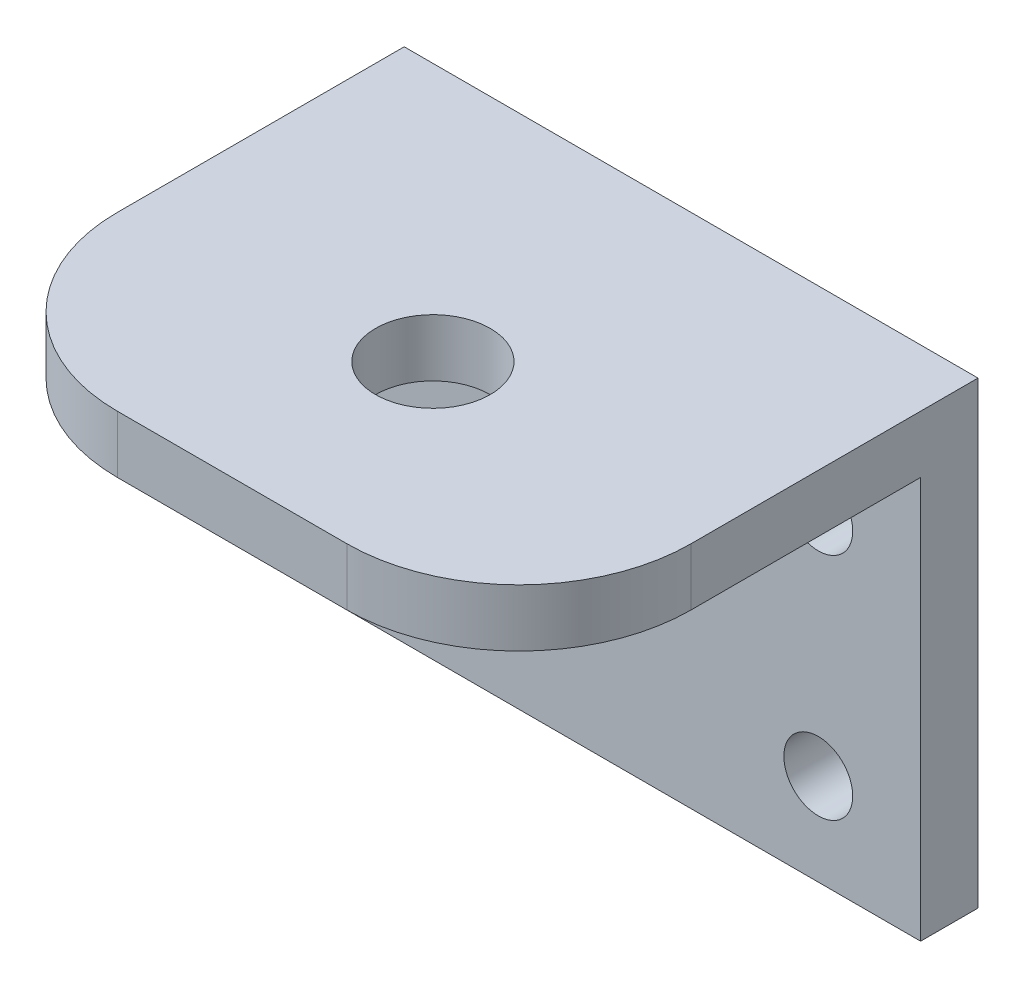
ISO-10303-21;
HEADER;
FILE_DESCRIPTION(('STEP AP214'),'2;1');
FILE_NAME('part.step','',(''),(''),'','','');
FILE_SCHEMA(('AUTOMOTIVE_DESIGN { 1 0 10303 214 1 1 1 1 }'));
ENDSEC;
DATA;
#1=APPLICATION_CONTEXT('core data for automotive mechanical design processes');
#2=APPLICATION_PROTOCOL_DEFINITION('international standard','automotive_design',2000,#1);
#3=PRODUCT_CONTEXT('',#1,'mechanical');
#4=PRODUCT('Part','Part','',(#3));
#5=PRODUCT_RELATED_PRODUCT_CATEGORY('part','',(#4));
#6=PRODUCT_DEFINITION_FORMATION('','',#4);
#7=PRODUCT_DEFINITION_CONTEXT('part definition',#1,'design');
#8=PRODUCT_DEFINITION('design','',#6,#7);
#9=PRODUCT_DEFINITION_SHAPE('','',#8);
#10=(LENGTH_UNIT() NAMED_UNIT(*) SI_UNIT(.MILLI.,.METRE.));
#11=(NAMED_UNIT(*) PLANE_ANGLE_UNIT() SI_UNIT($,.RADIAN.));
#12=(NAMED_UNIT(*) SI_UNIT($,.STERADIAN.) SOLID_ANGLE_UNIT());
#13=UNCERTAINTY_MEASURE_WITH_UNIT(LENGTH_MEASURE(1.E-05),#10,'distance_accuracy_value','');
#14=(GEOMETRIC_REPRESENTATION_CONTEXT(3) GLOBAL_UNCERTAINTY_ASSIGNED_CONTEXT((#13)) GLOBAL_UNIT_ASSIGNED_CONTEXT((#10,
#11,#12)) REPRESENTATION_CONTEXT('',''));
#15=CARTESIAN_POINT('',(0.,0.,0.));
#16=DIRECTION('',(0.,0.,1.));
#17=DIRECTION('',(1.,0.,0.));
#18=AXIS2_PLACEMENT_3D('',#15,#16,#17);
#19=CARTESIAN_POINT('',(25.,-20.,40.));
#20=DIRECTION('',(-1.,0.,0.));
#21=DIRECTION('',(0.,0.,1.));
#22=AXIS2_PLACEMENT_3D('',#19,#20,#21);
#23=PLANE('',#22);
#24=DIRECTION('',(0.,0.,-1.));
#25=VECTOR('',#24,1.);
#26=CARTESIAN_POINT('',(25.,20.,40.));
#27=LINE('',#26,#25);
#28=CARTESIAN_POINT('',(25.,20.,25.));
#29=VERTEX_POINT('',#28);
#30=CARTESIAN_POINT('',(25.,20.,0.));
#31=VERTEX_POINT('',#30);
#32=EDGE_CURVE('E145',#29,#31,#27,.T.);
#33=ORIENTED_EDGE('',*,*,#32,.F.);
#34=DIRECTION('',(0.,1.,0.));
#35=VECTOR('',#34,1.);
#36=CARTESIAN_POINT('',(25.,-20.,25.));
#37=LINE('',#36,#35);
#38=CARTESIAN_POINT('',(25.,15.,25.));
#39=VERTEX_POINT('',#38);
#40=EDGE_CURVE('E11',#29,#39,#37,.F.);
#41=ORIENTED_EDGE('',*,*,#40,.T.);
#42=DIRECTION('',(0.,0.,1.));
#43=VECTOR('',#42,1.);
#44=CARTESIAN_POINT('',(25.,15.,40.));
#45=LINE('',#44,#43);
#46=CARTESIAN_POINT('',(25.,15.,5.));
#47=VERTEX_POINT('',#46);
#48=EDGE_CURVE('E114',#47,#39,#45,.T.);
#49=ORIENTED_EDGE('',*,*,#48,.F.);
#50=DIRECTION('',(0.,-1.,0.));
#51=VECTOR('',#50,1.);
#52=CARTESIAN_POINT('',(25.,15.,5.));
#53=LINE('',#52,#51);
#54=CARTESIAN_POINT('',(25.,-20.,5.));
#55=VERTEX_POINT('',#54);
#56=EDGE_CURVE('E113',#47,#55,#53,.T.);
#57=ORIENTED_EDGE('',*,*,#56,.T.);
#58=DIRECTION('',(0.,0.,-1.));
#59=VECTOR('',#58,1.);
#60=CARTESIAN_POINT('',(25.,-20.,40.));
#61=LINE('',#60,#59);
#62=CARTESIAN_POINT('',(25.,-20.,0.));
#63=VERTEX_POINT('',#62);
#64=EDGE_CURVE('E130',#55,#63,#61,.T.);
#65=ORIENTED_EDGE('',*,*,#64,.T.);
#66=DIRECTION('',(0.,1.,0.));
#67=VECTOR('',#66,1.);
#68=CARTESIAN_POINT('',(25.,-20.,0.));
#69=LINE('',#68,#67);
#70=EDGE_CURVE('E122',#63,#31,#69,.T.);
#71=ORIENTED_EDGE('',*,*,#70,.T.);
#72=EDGE_LOOP('',(#33,#41,#49,#57,#65,#71));
#73=FACE_BOUND('',#72,.T.);
#74=ADVANCED_FACE('F33',(#73),#23,.F.);
#75=CARTESIAN_POINT('',(-25.,20.,40.));
#76=DIRECTION('',(0.,-1.,0.));
#77=DIRECTION('',(0.,0.,-1.));
#78=AXIS2_PLACEMENT_3D('',#75,#76,#77);
#79=PLANE('',#78);
#80=CARTESIAN_POINT('',(0.,20.,22.5));
#81=DIRECTION('',(0.,-1.,0.));
#82=DIRECTION('',(0.,0.,-1.));
#83=AXIS2_PLACEMENT_3D('',#80,#81,#82);
#84=CIRCLE('',#83,5.);
#85=CARTESIAN_POINT('',(0.,20.,17.5));
#86=VERTEX_POINT('',#85);
#87=EDGE_CURVE('E256',#86,#86,#84,.T.);
#88=ORIENTED_EDGE('',*,*,#87,.T.);
#89=EDGE_LOOP('',(#88));
#90=FACE_BOUND('',#89,.T.);
#91=DIRECTION('',(0.,0.,-1.));
#92=VECTOR('',#91,1.);
#93=CARTESIAN_POINT('',(-25.,20.,40.));
#94=LINE('',#93,#92);
#95=CARTESIAN_POINT('',(-25.,20.,25.));
#96=VERTEX_POINT('',#95);
#97=CARTESIAN_POINT('',(-25.,20.,0.));
#98=VERTEX_POINT('',#97);
#99=EDGE_CURVE('E143',#96,#98,#94,.T.);
#100=ORIENTED_EDGE('',*,*,#99,.F.);
#101=CARTESIAN_POINT('',(-10.,20.,25.));
#102=DIRECTION('',(0.,-1.,0.));
#103=DIRECTION('',(0.,0.,-1.));
#104=AXIS2_PLACEMENT_3D('',#101,#102,#103);
#105=CIRCLE('',#104,15.);
#106=CARTESIAN_POINT('',(-10.,20.,40.));
#107=VERTEX_POINT('',#106);
#108=EDGE_CURVE('E41',#96,#107,#105,.F.);
#109=ORIENTED_EDGE('',*,*,#108,.T.);
#110=DIRECTION('',(-1.,0.,0.));
#111=VECTOR('',#110,1.);
#112=CARTESIAN_POINT('',(-25.,20.,40.));
#113=LINE('',#112,#111);
#114=CARTESIAN_POINT('',(10.,20.,40.));
#115=VERTEX_POINT('',#114);
#116=EDGE_CURVE('E127',#115,#107,#113,.T.);
#117=ORIENTED_EDGE('',*,*,#116,.F.);
#118=CARTESIAN_POINT('',(10.,20.,25.));
#119=DIRECTION('',(0.,-1.,0.));
#120=DIRECTION('',(0.,0.,-1.));
#121=AXIS2_PLACEMENT_3D('',#118,#119,#120);
#122=CIRCLE('',#121,15.);
#123=EDGE_CURVE('E48',#115,#29,#122,.F.);
#124=ORIENTED_EDGE('',*,*,#123,.T.);
#125=ORIENTED_EDGE('',*,*,#32,.T.);
#126=DIRECTION('',(-1.,0.,0.));
#127=VECTOR('',#126,1.);
#128=CARTESIAN_POINT('',(-25.,20.,0.));
#129=LINE('',#128,#127);
#130=EDGE_CURVE('E134',#31,#98,#129,.T.);
#131=ORIENTED_EDGE('',*,*,#130,.T.);
#132=EDGE_LOOP('',(#100,#109,#117,#124,#125,#131));
#133=FACE_BOUND('',#132,.T.);
#134=ADVANCED_FACE('F173',(#90,#133),#79,.F.);
#135=CARTESIAN_POINT('',(-25.,-20.,40.));
#136=DIRECTION('',(1.,0.,0.));
#137=DIRECTION('',(0.,0.,-1.));
#138=AXIS2_PLACEMENT_3D('',#135,#136,#137);
#139=PLANE('',#138);
#140=DIRECTION('',(0.,0.,-1.));
#141=VECTOR('',#140,1.);
#142=CARTESIAN_POINT('',(-25.,15.,40.));
#143=LINE('',#142,#141);
#144=CARTESIAN_POINT('',(-25.,15.,25.));
#145=VERTEX_POINT('',#144);
#146=CARTESIAN_POINT('',(-25.,15.,5.));
#147=VERTEX_POINT('',#146);
#148=EDGE_CURVE('E97',#145,#147,#143,.T.);
#149=ORIENTED_EDGE('',*,*,#148,.F.);
#150=DIRECTION('',(0.,-1.,0.));
#151=VECTOR('',#150,1.);
#152=CARTESIAN_POINT('',(-25.,-20.,25.));
#153=LINE('',#152,#151);
#154=EDGE_CURVE('E56',#145,#96,#153,.F.);
#155=ORIENTED_EDGE('',*,*,#154,.T.);
#156=ORIENTED_EDGE('',*,*,#99,.T.);
#157=DIRECTION('',(0.,-1.,0.));
#158=VECTOR('',#157,1.);
#159=CARTESIAN_POINT('',(-25.,-20.,0.));
#160=LINE('',#159,#158);
#161=CARTESIAN_POINT('',(-25.,-20.,0.));
#162=VERTEX_POINT('',#161);
#163=EDGE_CURVE('E137',#98,#162,#160,.T.);
#164=ORIENTED_EDGE('',*,*,#163,.T.);
#165=DIRECTION('',(0.,0.,-1.));
#166=VECTOR('',#165,1.);
#167=CARTESIAN_POINT('',(-25.,-20.,40.));
#168=LINE('',#167,#166);
#169=CARTESIAN_POINT('',(-25.,-20.,5.));
#170=VERTEX_POINT('',#169);
#171=EDGE_CURVE('E119',#170,#162,#168,.T.);
#172=ORIENTED_EDGE('',*,*,#171,.F.);
#173=DIRECTION('',(0.,-1.,0.));
#174=VECTOR('',#173,1.);
#175=CARTESIAN_POINT('',(-25.,15.,5.));
#176=LINE('',#175,#174);
#177=EDGE_CURVE('E110',#147,#170,#176,.T.);
#178=ORIENTED_EDGE('',*,*,#177,.F.);
#179=EDGE_LOOP('',(#149,#155,#156,#164,#172,#178));
#180=FACE_BOUND('',#179,.T.);
#181=ADVANCED_FACE('F117',(#180),#139,.F.);
#182=CARTESIAN_POINT('',(-25.,-20.,40.));
#183=DIRECTION('',(0.,1.,0.));
#184=DIRECTION('',(0.,0.,1.));
#185=AXIS2_PLACEMENT_3D('',#182,#183,#184);
#186=PLANE('',#185);
#187=ORIENTED_EDGE('',*,*,#64,.F.);
#188=DIRECTION('',(1.,0.,0.));
#189=VECTOR('',#188,1.);
#190=CARTESIAN_POINT('',(25.,-20.,5.));
#191=LINE('',#190,#189);
#192=EDGE_CURVE('E106',#170,#55,#191,.T.);
#193=ORIENTED_EDGE('',*,*,#192,.F.);
#194=ORIENTED_EDGE('',*,*,#171,.T.);
#195=DIRECTION('',(1.,0.,0.));
#196=VECTOR('',#195,1.);
#197=CARTESIAN_POINT('',(-25.,-20.,0.));
#198=LINE('',#197,#196);
#199=EDGE_CURVE('E131',#162,#63,#198,.T.);
#200=ORIENTED_EDGE('',*,*,#199,.T.);
#201=EDGE_LOOP('',(#187,#193,#194,#200));
#202=FACE_BOUND('',#201,.T.);
#203=ADVANCED_FACE('F202',(#202),#186,.F.);
#204=CARTESIAN_POINT('',(0.,0.,40.));
#205=DIRECTION('',(0.,0.,-1.));
#206=DIRECTION('',(-1.,0.,0.));
#207=AXIS2_PLACEMENT_3D('',#204,#205,#206);
#208=PLANE('',#207);
#209=ORIENTED_EDGE('',*,*,#116,.T.);
#210=DIRECTION('',(0.,-1.,0.));
#211=VECTOR('',#210,1.);
#212=CARTESIAN_POINT('',(-10.,0.,40.));
#213=LINE('',#212,#211);
#214=CARTESIAN_POINT('',(-10.,15.,40.));
#215=VERTEX_POINT('',#214);
#216=EDGE_CURVE('E165',#107,#215,#213,.T.);
#217=ORIENTED_EDGE('',*,*,#216,.T.);
#218=DIRECTION('',(-1.,0.,0.));
#219=VECTOR('',#218,1.);
#220=CARTESIAN_POINT('',(25.,15.,40.));
#221=LINE('',#220,#219);
#222=CARTESIAN_POINT('',(10.,15.,40.));
#223=VERTEX_POINT('',#222);
#224=EDGE_CURVE('E120',#223,#215,#221,.T.);
#225=ORIENTED_EDGE('',*,*,#224,.F.);
#226=DIRECTION('',(0.,1.,0.));
#227=VECTOR('',#226,1.);
#228=CARTESIAN_POINT('',(10.,0.,40.));
#229=LINE('',#228,#227);
#230=EDGE_CURVE('E147',#223,#115,#229,.T.);
#231=ORIENTED_EDGE('',*,*,#230,.T.);
#232=EDGE_LOOP('',(#209,#217,#225,#231));
#233=FACE_BOUND('',#232,.T.);
#234=ADVANCED_FACE('F177',(#233),#208,.F.);
#235=CARTESIAN_POINT('',(0.,0.,0.));
#236=DIRECTION('',(0.,0.,-1.));
#237=DIRECTION('',(-1.,0.,0.));
#238=AXIS2_PLACEMENT_3D('',#235,#236,#237);
#239=PLANE('',#238);
#240=CARTESIAN_POINT('',(16.0827883139668,-12.,0.));
#241=DIRECTION('',(0.,0.,-1.));
#242=DIRECTION('',(-1.,0.,0.));
#243=AXIS2_PLACEMENT_3D('',#240,#241,#242);
#244=CIRCLE('',#243,3.);
#245=CARTESIAN_POINT('',(13.0827883139668,-12.,0.));
#246=VERTEX_POINT('',#245);
#247=EDGE_CURVE('E157',#246,#246,#244,.T.);
#248=ORIENTED_EDGE('',*,*,#247,.F.);
#249=EDGE_LOOP('',(#248));
#250=FACE_BOUND('',#249,.T.);
#251=CARTESIAN_POINT('',(16.0827883139668,8.,0.));
#252=DIRECTION('',(0.,0.,-1.));
#253=DIRECTION('',(-1.,0.,0.));
#254=AXIS2_PLACEMENT_3D('',#251,#252,#253);
#255=CIRCLE('',#254,3.);
#256=CARTESIAN_POINT('',(13.0827883139668,8.,0.));
#257=VERTEX_POINT('',#256);
#258=EDGE_CURVE('E237',#257,#257,#255,.T.);
#259=ORIENTED_EDGE('',*,*,#258,.F.);
#260=EDGE_LOOP('',(#259));
#261=FACE_BOUND('',#260,.T.);
#262=CARTESIAN_POINT('',(-13.9172116860332,8.,0.));
#263=DIRECTION('',(0.,0.,-1.));
#264=DIRECTION('',(-1.,0.,0.));
#265=AXIS2_PLACEMENT_3D('',#262,#263,#264);
#266=CIRCLE('',#265,3.);
#267=CARTESIAN_POINT('',(-16.9172116860332,8.,0.));
#268=VERTEX_POINT('',#267);
#269=EDGE_CURVE('E247',#268,#268,#266,.T.);
#270=ORIENTED_EDGE('',*,*,#269,.F.);
#271=EDGE_LOOP('',(#270));
#272=FACE_BOUND('',#271,.T.);
#273=CARTESIAN_POINT('',(-13.9172116860332,-12.,0.));
#274=DIRECTION('',(0.,0.,-1.));
#275=DIRECTION('',(-1.,0.,0.));
#276=AXIS2_PLACEMENT_3D('',#273,#274,#275);
#277=CIRCLE('',#276,3.);
#278=CARTESIAN_POINT('',(-16.9172116860332,-12.,0.));
#279=VERTEX_POINT('',#278);
#280=EDGE_CURVE('E152',#279,#279,#277,.T.);
#281=ORIENTED_EDGE('',*,*,#280,.F.);
#282=EDGE_LOOP('',(#281));
#283=FACE_BOUND('',#282,.T.);
#284=ORIENTED_EDGE('',*,*,#70,.F.);
#285=ORIENTED_EDGE('',*,*,#199,.F.);
#286=ORIENTED_EDGE('',*,*,#163,.F.);
#287=ORIENTED_EDGE('',*,*,#130,.F.);
#288=EDGE_LOOP('',(#284,#285,#286,#287));
#289=FACE_BOUND('',#288,.T.);
#290=ADVANCED_FACE('F206',(#250,#261,#272,#283,#289),#239,.T.);
#291=CARTESIAN_POINT('',(25.,15.,5.));
#292=DIRECTION('',(0.,0.,-1.));
#293=DIRECTION('',(-1.,0.,0.));
#294=AXIS2_PLACEMENT_3D('',#291,#292,#293);
#295=PLANE('',#294);
#296=CARTESIAN_POINT('',(16.0827883139668,-12.,5.));
#297=DIRECTION('',(0.,0.,-1.));
#298=DIRECTION('',(-1.,0.,0.));
#299=AXIS2_PLACEMENT_3D('',#296,#297,#298);
#300=CIRCLE('',#299,3.);
#301=CARTESIAN_POINT('',(13.0827883139668,-12.,5.));
#302=VERTEX_POINT('',#301);
#303=EDGE_CURVE('E160',#302,#302,#300,.T.);
#304=ORIENTED_EDGE('',*,*,#303,.T.);
#305=EDGE_LOOP('',(#304));
#306=FACE_BOUND('',#305,.T.);
#307=CARTESIAN_POINT('',(16.0827883139668,8.,5.));
#308=DIRECTION('',(0.,0.,-1.));
#309=DIRECTION('',(-1.,0.,0.));
#310=AXIS2_PLACEMENT_3D('',#307,#308,#309);
#311=CIRCLE('',#310,3.);
#312=CARTESIAN_POINT('',(13.0827883139668,8.,5.));
#313=VERTEX_POINT('',#312);
#314=EDGE_CURVE('E156',#313,#313,#311,.T.);
#315=ORIENTED_EDGE('',*,*,#314,.T.);
#316=EDGE_LOOP('',(#315));
#317=FACE_BOUND('',#316,.T.);
#318=CARTESIAN_POINT('',(-13.9172116860332,8.,5.));
#319=DIRECTION('',(0.,0.,-1.));
#320=DIRECTION('',(-1.,0.,0.));
#321=AXIS2_PLACEMENT_3D('',#318,#319,#320);
#322=CIRCLE('',#321,3.);
#323=CARTESIAN_POINT('',(-16.9172116860332,8.,5.));
#324=VERTEX_POINT('',#323);
#325=EDGE_CURVE('E153',#324,#324,#322,.T.);
#326=ORIENTED_EDGE('',*,*,#325,.T.);
#327=EDGE_LOOP('',(#326));
#328=FACE_BOUND('',#327,.T.);
#329=CARTESIAN_POINT('',(-13.9172116860332,-12.,5.));
#330=DIRECTION('',(0.,0.,-1.));
#331=DIRECTION('',(-1.,0.,0.));
#332=AXIS2_PLACEMENT_3D('',#329,#330,#331);
#333=CIRCLE('',#332,3.);
#334=CARTESIAN_POINT('',(-16.9172116860332,-12.,5.));
#335=VERTEX_POINT('',#334);
#336=EDGE_CURVE('E148',#335,#335,#333,.T.);
#337=ORIENTED_EDGE('',*,*,#336,.T.);
#338=EDGE_LOOP('',(#337));
#339=FACE_BOUND('',#338,.T.);
#340=ORIENTED_EDGE('',*,*,#192,.T.);
#341=ORIENTED_EDGE('',*,*,#56,.F.);
#342=DIRECTION('',(1.,0.,0.));
#343=VECTOR('',#342,1.);
#344=CARTESIAN_POINT('',(25.,15.,5.));
#345=LINE('',#344,#343);
#346=EDGE_CURVE('E102',#147,#47,#345,.T.);
#347=ORIENTED_EDGE('',*,*,#346,.F.);
#348=ORIENTED_EDGE('',*,*,#177,.T.);
#349=EDGE_LOOP('',(#340,#341,#347,#348));
#350=FACE_BOUND('',#349,.T.);
#351=ADVANCED_FACE('F109',(#306,#317,#328,#339,#350),#295,.F.);
#352=CARTESIAN_POINT('',(0.,15.,0.));
#353=DIRECTION('',(0.,1.,0.));
#354=DIRECTION('',(0.,0.,1.));
#355=AXIS2_PLACEMENT_3D('',#352,#353,#354);
#356=PLANE('',#355);
#357=CARTESIAN_POINT('',(0.,15.,22.5));
#358=DIRECTION('',(0.,-1.,0.));
#359=DIRECTION('',(0.,0.,-1.));
#360=AXIS2_PLACEMENT_3D('',#357,#358,#359);
#361=CIRCLE('',#360,5.);
#362=CARTESIAN_POINT('',(0.,15.,17.5));
#363=VERTEX_POINT('',#362);
#364=EDGE_CURVE('E151',#363,#363,#361,.T.);
#365=ORIENTED_EDGE('',*,*,#364,.F.);
#366=EDGE_LOOP('',(#365));
#367=FACE_BOUND('',#366,.T.);
#368=ORIENTED_EDGE('',*,*,#224,.T.);
#369=CARTESIAN_POINT('',(-10.,15.,25.));
#370=DIRECTION('',(0.,1.,0.));
#371=DIRECTION('',(0.,0.,1.));
#372=AXIS2_PLACEMENT_3D('',#369,#370,#371);
#373=CIRCLE('',#372,15.);
#374=EDGE_CURVE('E104',#215,#145,#373,.F.);
#375=ORIENTED_EDGE('',*,*,#374,.T.);
#376=ORIENTED_EDGE('',*,*,#148,.T.);
#377=ORIENTED_EDGE('',*,*,#346,.T.);
#378=ORIENTED_EDGE('',*,*,#48,.T.);
#379=CARTESIAN_POINT('',(10.,15.,25.));
#380=DIRECTION('',(0.,1.,0.));
#381=DIRECTION('',(0.,0.,1.));
#382=AXIS2_PLACEMENT_3D('',#379,#380,#381);
#383=CIRCLE('',#382,15.);
#384=EDGE_CURVE('E168',#39,#223,#383,.F.);
#385=ORIENTED_EDGE('',*,*,#384,.T.);
#386=EDGE_LOOP('',(#368,#375,#376,#377,#378,#385));
#387=FACE_BOUND('',#386,.T.);
#388=ADVANCED_FACE('F100',(#367,#387),#356,.F.);
#389=CARTESIAN_POINT('',(0.,20.,22.5));
#390=DIRECTION('',(0.,-1.,0.));
#391=DIRECTION('',(0.,0.,-1.));
#392=AXIS2_PLACEMENT_3D('',#389,#390,#391);
#393=CYLINDRICAL_SURFACE('',#392,5.);
#394=ORIENTED_EDGE('',*,*,#87,.F.);
#395=EDGE_LOOP('',(#394));
#396=FACE_BOUND('',#395,.T.);
#397=ORIENTED_EDGE('',*,*,#364,.T.);
#398=EDGE_LOOP('',(#397));
#399=FACE_BOUND('',#398,.T.);
#400=ADVANCED_FACE('F217',(#396,#399),#393,.F.);
#401=CARTESIAN_POINT('',(-13.9172116860332,-12.,10.));
#402=DIRECTION('',(0.,0.,-1.));
#403=DIRECTION('',(-1.,0.,0.));
#404=AXIS2_PLACEMENT_3D('',#401,#402,#403);
#405=CYLINDRICAL_SURFACE('',#404,3.);
#406=ORIENTED_EDGE('',*,*,#280,.T.);
#407=EDGE_LOOP('',(#406));
#408=FACE_BOUND('',#407,.T.);
#409=ORIENTED_EDGE('',*,*,#336,.F.);
#410=EDGE_LOOP('',(#409));
#411=FACE_BOUND('',#410,.T.);
#412=ADVANCED_FACE('F221',(#408,#411),#405,.F.);
#413=CARTESIAN_POINT('',(-13.9172116860332,8.,10.));
#414=DIRECTION('',(0.,0.,-1.));
#415=DIRECTION('',(-1.,0.,0.));
#416=AXIS2_PLACEMENT_3D('',#413,#414,#415);
#417=CYLINDRICAL_SURFACE('',#416,3.);
#418=ORIENTED_EDGE('',*,*,#269,.T.);
#419=EDGE_LOOP('',(#418));
#420=FACE_BOUND('',#419,.T.);
#421=ORIENTED_EDGE('',*,*,#325,.F.);
#422=EDGE_LOOP('',(#421));
#423=FACE_BOUND('',#422,.T.);
#424=ADVANCED_FACE('F225',(#420,#423),#417,.F.);
#425=CARTESIAN_POINT('',(16.0827883139668,8.,10.));
#426=DIRECTION('',(0.,0.,-1.));
#427=DIRECTION('',(-1.,0.,0.));
#428=AXIS2_PLACEMENT_3D('',#425,#426,#427);
#429=CYLINDRICAL_SURFACE('',#428,3.);
#430=ORIENTED_EDGE('',*,*,#258,.T.);
#431=EDGE_LOOP('',(#430));
#432=FACE_BOUND('',#431,.T.);
#433=ORIENTED_EDGE('',*,*,#314,.F.);
#434=EDGE_LOOP('',(#433));
#435=FACE_BOUND('',#434,.T.);
#436=ADVANCED_FACE('F188',(#432,#435),#429,.F.);
#437=CARTESIAN_POINT('',(16.0827883139668,-12.,10.));
#438=DIRECTION('',(0.,0.,-1.));
#439=DIRECTION('',(-1.,0.,0.));
#440=AXIS2_PLACEMENT_3D('',#437,#438,#439);
#441=CYLINDRICAL_SURFACE('',#440,3.);
#442=ORIENTED_EDGE('',*,*,#247,.T.);
#443=EDGE_LOOP('',(#442));
#444=FACE_BOUND('',#443,.T.);
#445=ORIENTED_EDGE('',*,*,#303,.F.);
#446=EDGE_LOOP('',(#445));
#447=FACE_BOUND('',#446,.T.);
#448=ADVANCED_FACE('F182',(#444,#447),#441,.F.);
#449=CARTESIAN_POINT('',(-10.,0.,25.));
#450=DIRECTION('',(0.,-1.,0.));
#451=DIRECTION('',(0.,0.,-1.));
#452=AXIS2_PLACEMENT_3D('',#449,#450,#451);
#453=CYLINDRICAL_SURFACE('',#452,15.);
#454=ORIENTED_EDGE('',*,*,#108,.F.);
#455=ORIENTED_EDGE('',*,*,#154,.F.);
#456=ORIENTED_EDGE('',*,*,#374,.F.);
#457=ORIENTED_EDGE('',*,*,#216,.F.);
#458=EDGE_LOOP('',(#454,#455,#456,#457));
#459=FACE_BOUND('',#458,.T.);
#460=ADVANCED_FACE('F180',(#459),#453,.T.);
#461=CARTESIAN_POINT('',(10.,0.,25.));
#462=DIRECTION('',(0.,1.,0.));
#463=DIRECTION('',(0.,0.,1.));
#464=AXIS2_PLACEMENT_3D('',#461,#462,#463);
#465=CYLINDRICAL_SURFACE('',#464,15.);
#466=ORIENTED_EDGE('',*,*,#384,.F.);
#467=ORIENTED_EDGE('',*,*,#40,.F.);
#468=ORIENTED_EDGE('',*,*,#123,.F.);
#469=ORIENTED_EDGE('',*,*,#230,.F.);
#470=EDGE_LOOP('',(#466,#467,#468,#469));
#471=FACE_BOUND('',#470,.T.);
#472=ADVANCED_FACE('F35',(#471),#465,.T.);
#473=CLOSED_SHELL('',(#74,#134,#181,#203,#234,#290,#351,#388,#400,#412,#424,#436,#448,#460,#472));
#474=MANIFOLD_SOLID_BREP('B2',#473);
#475=ADVANCED_BREP_SHAPE_REPRESENTATION('',(#18,#474),#14);
#476=SHAPE_DEFINITION_REPRESENTATION(#9,#475);
ENDSEC;
END-ISO-10303-21;
